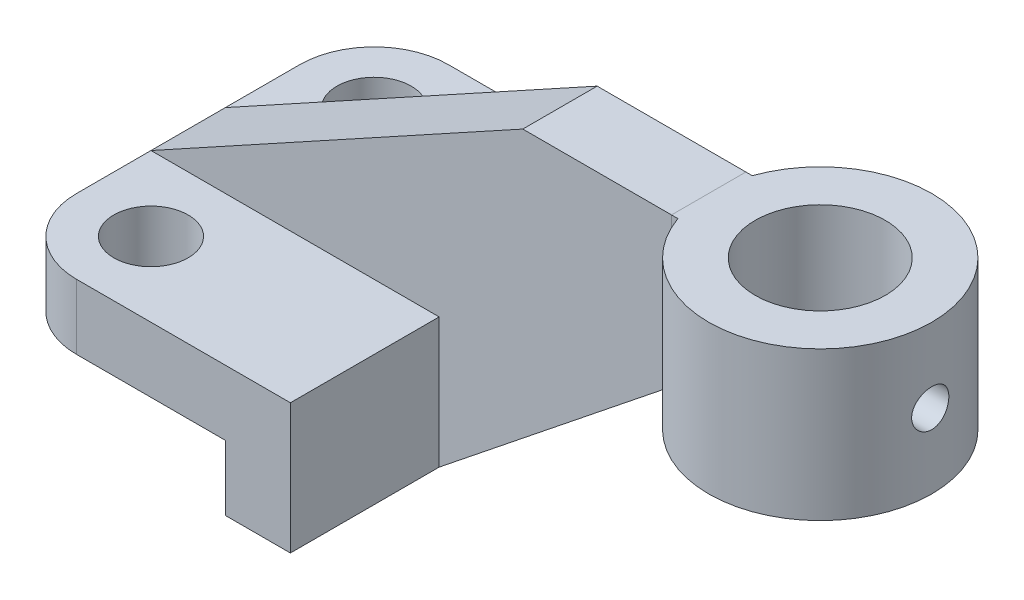
ISO-10303-21;
HEADER;
FILE_DESCRIPTION(('STEP AP214'),'2;1');
FILE_NAME('part.step','',(''),(''),'','','');
FILE_SCHEMA(('AUTOMOTIVE_DESIGN { 1 0 10303 214 1 1 1 1 }'));
ENDSEC;
DATA;
#1=APPLICATION_CONTEXT('core data for automotive mechanical design processes');
#2=APPLICATION_PROTOCOL_DEFINITION('international standard','automotive_design',2000,#1);
#3=PRODUCT_CONTEXT('',#1,'mechanical');
#4=PRODUCT('Part','Part','',(#3));
#5=PRODUCT_RELATED_PRODUCT_CATEGORY('part','',(#4));
#6=PRODUCT_DEFINITION_FORMATION('','',#4);
#7=PRODUCT_DEFINITION_CONTEXT('part definition',#1,'design');
#8=PRODUCT_DEFINITION('design','',#6,#7);
#9=PRODUCT_DEFINITION_SHAPE('','',#8);
#10=(LENGTH_UNIT() NAMED_UNIT(*) SI_UNIT(.MILLI.,.METRE.));
#11=(NAMED_UNIT(*) PLANE_ANGLE_UNIT() SI_UNIT($,.RADIAN.));
#12=(NAMED_UNIT(*) SI_UNIT($,.STERADIAN.) SOLID_ANGLE_UNIT());
#13=UNCERTAINTY_MEASURE_WITH_UNIT(LENGTH_MEASURE(1.E-05),#10,'distance_accuracy_value','');
#14=(GEOMETRIC_REPRESENTATION_CONTEXT(3) GLOBAL_UNCERTAINTY_ASSIGNED_CONTEXT((#13)) GLOBAL_UNIT_ASSIGNED_CONTEXT((#10,
#11,#12)) REPRESENTATION_CONTEXT('',''));
#15=CARTESIAN_POINT('',(0.,0.,0.));
#16=DIRECTION('',(0.,0.,1.));
#17=DIRECTION('',(1.,0.,0.));
#18=AXIS2_PLACEMENT_3D('',#15,#16,#17);
#19=CARTESIAN_POINT('',(25.4,9.525,-6.35));
#20=DIRECTION('',(-1.,0.,0.));
#21=DIRECTION('',(0.,0.,1.));
#22=AXIS2_PLACEMENT_3D('',#19,#20,#21);
#23=PLANE('',#22);
#24=DIRECTION('',(0.,0.,1.));
#25=VECTOR('',#24,1.);
#26=CARTESIAN_POINT('',(25.4,34.925,-6.35));
#27=LINE('',#26,#25);
#28=CARTESIAN_POINT('',(25.4,34.925,-6.35));
#29=VERTEX_POINT('',#28);
#30=CARTESIAN_POINT('',(25.4,34.925,6.35));
#31=VERTEX_POINT('',#30);
#32=EDGE_CURVE('E131',#29,#31,#27,.T.);
#33=ORIENTED_EDGE('',*,*,#32,.F.);
#34=DIRECTION('',(0.,1.,0.));
#35=VECTOR('',#34,1.);
#36=CARTESIAN_POINT('',(25.4,9.525,-6.35));
#37=LINE('',#36,#35);
#38=CARTESIAN_POINT('',(25.4,9.525,-6.35));
#39=VERTEX_POINT('',#38);
#40=EDGE_CURVE('E14',#39,#29,#37,.T.);
#41=ORIENTED_EDGE('',*,*,#40,.F.);
#42=DIRECTION('',(0.,0.,1.));
#43=VECTOR('',#42,1.);
#44=CARTESIAN_POINT('',(25.4,9.525,-6.35));
#45=LINE('',#44,#43);
#46=CARTESIAN_POINT('',(25.4,9.525,6.35));
#47=VERTEX_POINT('',#46);
#48=EDGE_CURVE('E124',#39,#47,#45,.T.);
#49=ORIENTED_EDGE('',*,*,#48,.T.);
#50=DIRECTION('',(0.,1.,0.));
#51=VECTOR('',#50,1.);
#52=CARTESIAN_POINT('',(25.4,9.525,6.35));
#53=LINE('',#52,#51);
#54=EDGE_CURVE('E107',#47,#31,#53,.T.);
#55=ORIENTED_EDGE('',*,*,#54,.T.);
#56=EDGE_LOOP('',(#33,#41,#49,#55));
#57=FACE_BOUND('',#56,.T.);
#58=ADVANCED_FACE('F60',(#57),#23,.T.);
#59=CARTESIAN_POINT('',(25.4,9.525,-6.35));
#60=DIRECTION('',(0.,0.,-1.));
#61=DIRECTION('',(-1.,0.,0.));
#62=AXIS2_PLACEMENT_3D('',#59,#60,#61);
#63=PLANE('',#62);
#64=DIRECTION('',(-1.,0.,0.));
#65=VECTOR('',#64,1.);
#66=CARTESIAN_POINT('',(25.4,34.925,-6.35));
#67=LINE('',#66,#65);
#68=CARTESIAN_POINT('',(26.4894877578617,34.925,-6.35));
#69=VERTEX_POINT('',#68);
#70=EDGE_CURVE('E126',#69,#29,#67,.T.);
#71=ORIENTED_EDGE('',*,*,#70,.F.);
#72=DIRECTION('',(0.,1.,0.));
#73=VECTOR('',#72,1.);
#74=CARTESIAN_POINT('',(26.4894877578617,9.525,-6.35));
#75=LINE('',#74,#73);
#76=CARTESIAN_POINT('',(26.4894877578617,9.525,-6.35));
#77=VERTEX_POINT('',#76);
#78=EDGE_CURVE('E73',#77,#69,#75,.T.);
#79=ORIENTED_EDGE('',*,*,#78,.F.);
#80=DIRECTION('',(-1.,0.,0.));
#81=VECTOR('',#80,1.);
#82=CARTESIAN_POINT('',(25.4,9.525,-6.35));
#83=LINE('',#82,#81);
#84=EDGE_CURVE('E121',#77,#39,#83,.T.);
#85=ORIENTED_EDGE('',*,*,#84,.T.);
#86=ORIENTED_EDGE('',*,*,#40,.T.);
#87=EDGE_LOOP('',(#71,#79,#85,#86));
#88=FACE_BOUND('',#87,.T.);
#89=ADVANCED_FACE('F142',(#88),#63,.T.);
#90=CARTESIAN_POINT('',(44.45,9.525,0.));
#91=DIRECTION('',(0.,1.,0.));
#92=DIRECTION('',(0.,0.,1.));
#93=AXIS2_PLACEMENT_3D('',#90,#91,#92);
#94=CYLINDRICAL_SURFACE('',#93,19.05);
#95=CARTESIAN_POINT('',(63.2335533113412,22.225,-3.175));
#96=CARTESIAN_POINT('',(63.2335565065558,22.4020072001655,-3.17499288599318));
#97=CARTESIAN_POINT('',(63.2360824732924,22.5791110597108,-3.16014756466592));
#98=CARTESIAN_POINT('',(63.2459042064405,22.9283495499442,-3.1011843336443));
#99=CARTESIAN_POINT('',(63.2532043714989,23.1004794450727,-3.05703942859193));
#100=CARTESIAN_POINT('',(63.2717252389648,23.4346651998438,-2.94084952046153));
#101=CARTESIAN_POINT('',(63.2829426640368,23.5967293478011,-2.86882783476362));
#102=CARTESIAN_POINT('',(63.308030255699,23.9064558124916,-2.69898685104962));
#103=CARTESIAN_POINT('',(63.3219001237167,24.0541197473632,-2.60117045614669));
#104=CARTESIAN_POINT('',(63.3508825836796,24.3323273191756,-2.38148815924751));
#105=CARTESIAN_POINT('',(63.3660050600649,24.4627084168605,-2.25941769214407));
#106=CARTESIAN_POINT('',(63.3957010044909,24.7012374997145,-1.995134445963));
#107=CARTESIAN_POINT('',(63.410274439951,24.8093841671566,-1.85292047392046));
#108=CARTESIAN_POINT('',(63.4373348596803,25.0009845003685,-1.55133404483441));
#109=CARTESIAN_POINT('',(63.4498088688907,25.0842868998194,-1.39186422345002));
#110=CARTESIAN_POINT('',(63.471154959355,25.2228617595738,-1.06095243958931));
#111=CARTESIAN_POINT('',(63.4800272748027,25.2781360424138,-0.889511256379298));
#112=CARTESIAN_POINT('',(63.4931005309998,25.3585885194296,-0.541202532457187));
#113=CARTESIAN_POINT('',(63.4973438345085,25.384039803326,-0.364399686082673));
#114=CARTESIAN_POINT('',(63.5008265076532,25.4049730077738,-0.00898561261776089));
#115=CARTESIAN_POINT('',(63.5000662174102,25.400456965364,0.169625490731702));
#116=CARTESIAN_POINT('',(63.4936609020786,25.3617966835592,0.521718775050173));
#117=CARTESIAN_POINT('',(63.4880643328934,25.3279463424704,0.69523423398918));
#118=CARTESIAN_POINT('',(63.4726693303997,25.232041135707,1.03408731410698));
#119=CARTESIAN_POINT('',(63.4628707691177,25.1699854110213,1.19942468604741));
#120=CARTESIAN_POINT('',(63.4400902711018,25.0191388867995,1.51810230768396));
#121=CARTESIAN_POINT('',(63.4270939650513,24.9302269846553,1.67138416423419));
#122=CARTESIAN_POINT('',(63.399361873508,24.7282807152535,1.96096322290524));
#123=CARTESIAN_POINT('',(63.384625947273,24.6152443956373,2.09725904895316));
#124=CARTESIAN_POINT('',(63.3548424065539,24.3666279155935,2.35073351727727));
#125=CARTESIAN_POINT('',(63.3397931795842,24.2307908894757,2.46766016786157));
#126=CARTESIAN_POINT('',(63.311252089267,23.9412943954259,2.67710232732904));
#127=CARTESIAN_POINT('',(63.2977602402858,23.7876347631128,2.76961761103617));
#128=CARTESIAN_POINT('',(63.273860682935,23.4665626148156,2.92766043180012));
#129=CARTESIAN_POINT('',(63.263456445943,23.299134887423,2.99315762464464));
#130=CARTESIAN_POINT('',(63.2469675963614,22.9554416781694,3.09502793593583));
#131=CARTESIAN_POINT('',(63.2408826034316,22.7791769759308,3.1314036187753));
#132=CARTESIAN_POINT('',(63.2337947846608,22.4250679816741,3.17364349379667));
#133=CARTESIAN_POINT('',(63.2327321291351,22.2472676977783,3.1798669040488));
#134=CARTESIAN_POINT('',(63.235649941736,21.8931659269527,3.16258283240672));
#135=CARTESIAN_POINT('',(63.2396302150745,21.7168643823973,3.13907649885332));
#136=CARTESIAN_POINT('',(63.2521301306787,21.3719057458276,3.06330646535868));
#137=CARTESIAN_POINT('',(63.260620899363,21.2032073523549,3.01122561412091));
#138=CARTESIAN_POINT('',(63.2811608771698,20.876932888825,2.87997670154419));
#139=CARTESIAN_POINT('',(63.2932102991603,20.7193574848104,2.80080701978819));
#140=CARTESIAN_POINT('',(63.3196489306469,20.4182032651042,2.61677997500111));
#141=CARTESIAN_POINT('',(63.3340586961244,20.2747669525998,2.51169241648239));
#142=CARTESIAN_POINT('',(63.3635342668343,20.0074358134773,2.27912862144913));
#143=CARTESIAN_POINT('',(63.3786001181537,19.8835423624906,2.15165081020773));
#144=CARTESIAN_POINT('',(63.4078795609019,19.6575020962345,1.87633364931759));
#145=CARTESIAN_POINT('',(63.4220826595773,19.5555948406186,1.72829633180047));
#146=CARTESIAN_POINT('',(63.4478679278983,19.3780977347038,1.41699417889564));
#147=CARTESIAN_POINT('',(63.4594501823187,19.3025070331182,1.25372983628769));
#148=CARTESIAN_POINT('',(63.4786431487536,19.1801615583773,0.917319795406684));
#149=CARTESIAN_POINT('',(63.4862711040087,19.1332814238167,0.744220714505314));
#150=CARTESIAN_POINT('',(63.4967689062499,19.0692841893159,0.392469033290245));
#151=CARTESIAN_POINT('',(63.4996391447424,19.0521646404099,0.213816891163455));
#152=CARTESIAN_POINT('',(63.5002925811752,19.0482450094635,-0.141657420232572));
#153=CARTESIAN_POINT('',(63.4981369357072,19.0610804274948,-0.318475563965387));
#154=CARTESIAN_POINT('',(63.4891056655191,19.1159179812822,-0.667400207379679));
#155=CARTESIAN_POINT('',(63.4822300672288,19.1579199537173,-0.839506733438703));
#156=CARTESIAN_POINT('',(63.464528758108,19.2697584702404,-1.17398348631655));
#157=CARTESIAN_POINT('',(63.4537074464191,19.3395640236268,-1.33636432263535));
#158=CARTESIAN_POINT('',(63.429296012351,19.5049875790128,-1.64716517528736));
#159=CARTESIAN_POINT('',(63.4157057587261,19.6006068046293,-1.79558452937014));
#160=CARTESIAN_POINT('',(63.3870668961284,19.8162355674248,-2.07608544081853));
#161=CARTESIAN_POINT('',(63.3720033616722,19.9365120125341,-2.20796031686549));
#162=CARTESIAN_POINT('',(63.3422190520924,20.1974809510378,-2.44978412245766));
#163=CARTESIAN_POINT('',(63.3274983580787,20.3381782198189,-2.55972790912412));
#164=CARTESIAN_POINT('',(63.2999539628806,20.6371765595618,-2.7552831240568));
#165=CARTESIAN_POINT('',(63.2871444166414,20.7955951115022,-2.84071693610328));
#166=CARTESIAN_POINT('',(63.2650399681597,21.1246837295144,-2.98362946123343));
#167=CARTESIAN_POINT('',(63.2557415569059,21.2953413598003,-3.0411361011333));
#168=CARTESIAN_POINT('',(63.2437742596774,21.593052787249,-3.11407308747183));
#169=CARTESIAN_POINT('',(63.2399627174272,21.7183040461125,-3.13688402044266));
#170=CARTESIAN_POINT('',(63.2348511181585,21.9706869257429,-3.16734989488027));
#171=CARTESIAN_POINT('',(63.2335510155468,22.0978185123317,-3.17500511148682));
#172=CARTESIAN_POINT('',(63.2335533113412,22.225,-3.175));
#173=B_SPLINE_CURVE_WITH_KNOTS('',3,(#95,#96,#97,#98,#99,#100,#101,#102,#103,#104,#105,#106,
#107,#108,#109,#110,#111,#112,#113,#114,#115,#116,#117,#118,#119,#120,#121,#122,#123,#124,#125,
#126,#127,#128,#129,#130,#131,#132,#133,#134,#135,#136,#137,#138,#139,#140,#141,#142,#143,#144,
#145,#146,#147,#148,#149,#150,#151,#152,#153,#154,#155,#156,#157,#158,#159,#160,#161,#162,#163,
#164,#165,#166,#167,#168,#169,#170,#171,#172),.UNSPECIFIED.,.T.,.F.,(4,2,2,2,2,2,2,2,2,2,2,2,2,
2,2,2,2,2,2,2,2,2,2,2,2,2,2,2,2,2,2,2,2,2,2,2,2,2,4),(0.,0.530556519438233,1.06160255035297,
1.59220534730149,2.12274845204698,2.65797232127758,3.19322790149748,3.73167884741523,
4.27009477591114,4.80354090690158,5.33695077708919,5.86507743879129,6.39322018596907,
6.9237809725707,7.45438471307991,7.99142576796897,8.52847177647444,9.06611931373227,
9.60371950141358,10.1348989887392,10.6660579593575,11.1938570208707,11.7216876601284,
12.2543867530863,12.7871233262698,13.3254002355493,13.8636597310541,14.3995519021041,
14.9353999730869,15.4647617585771,15.9941205798791,16.5228910058722,17.0516865009827,
17.5865408677833,18.121520511799,18.6602843407527,19.1985082976546,19.5797255159058,
19.9609358134031),.UNSPECIFIED.);
#174=CARTESIAN_POINT('',(63.2335533113412,22.225,-3.175));
#175=VERTEX_POINT('',#174);
#176=EDGE_CURVE('E155',#175,#175,#173,.T.);
#177=ORIENTED_EDGE('',*,*,#176,.F.);
#178=EDGE_LOOP('',(#177));
#179=FACE_BOUND('',#178,.T.);
#180=CARTESIAN_POINT('',(44.45,34.925,0.));
#181=DIRECTION('',(0.,1.,0.));
#182=DIRECTION('',(0.,0.,1.));
#183=AXIS2_PLACEMENT_3D('',#180,#181,#182);
#184=CIRCLE('',#183,19.05);
#185=CARTESIAN_POINT('',(26.4894877578617,34.925,6.35));
#186=VERTEX_POINT('',#185);
#187=EDGE_CURVE('E115',#186,#69,#184,.T.);
#188=ORIENTED_EDGE('',*,*,#187,.F.);
#189=DIRECTION('',(0.,1.,0.));
#190=VECTOR('',#189,1.);
#191=CARTESIAN_POINT('',(26.4894877578617,9.525,6.35));
#192=LINE('',#191,#190);
#193=CARTESIAN_POINT('',(26.4894877578617,9.525,6.35));
#194=VERTEX_POINT('',#193);
#195=EDGE_CURVE('E110',#194,#186,#192,.T.);
#196=ORIENTED_EDGE('',*,*,#195,.F.);
#197=CARTESIAN_POINT('',(44.45,9.525,0.));
#198=DIRECTION('',(0.,1.,0.));
#199=DIRECTION('',(0.,0.,1.));
#200=AXIS2_PLACEMENT_3D('',#197,#198,#199);
#201=CIRCLE('',#200,19.05);
#202=EDGE_CURVE('E113',#194,#77,#201,.T.);
#203=ORIENTED_EDGE('',*,*,#202,.T.);
#204=ORIENTED_EDGE('',*,*,#78,.T.);
#205=EDGE_LOOP('',(#188,#196,#203,#204));
#206=FACE_BOUND('',#205,.T.);
#207=ADVANCED_FACE('F112',(#179,#206),#94,.T.);
#208=CARTESIAN_POINT('',(25.4,9.525,6.35));
#209=DIRECTION('',(0.,0.,1.));
#210=DIRECTION('',(1.,0.,0.));
#211=AXIS2_PLACEMENT_3D('',#208,#209,#210);
#212=PLANE('',#211);
#213=DIRECTION('',(1.,0.,0.));
#214=VECTOR('',#213,1.);
#215=CARTESIAN_POINT('',(25.4,34.925,6.35));
#216=LINE('',#215,#214);
#217=EDGE_CURVE('E134',#31,#186,#216,.T.);
#218=ORIENTED_EDGE('',*,*,#217,.F.);
#219=ORIENTED_EDGE('',*,*,#54,.F.);
#220=DIRECTION('',(1.,0.,0.));
#221=VECTOR('',#220,1.);
#222=CARTESIAN_POINT('',(25.4,9.525,6.35));
#223=LINE('',#222,#221);
#224=EDGE_CURVE('E120',#47,#194,#223,.T.);
#225=ORIENTED_EDGE('',*,*,#224,.T.);
#226=ORIENTED_EDGE('',*,*,#195,.T.);
#227=EDGE_LOOP('',(#218,#219,#225,#226));
#228=FACE_BOUND('',#227,.T.);
#229=ADVANCED_FACE('F123',(#228),#212,.T.);
#230=CARTESIAN_POINT('',(44.45,9.525,0.));
#231=DIRECTION('',(0.,1.,0.));
#232=DIRECTION('',(0.,0.,1.));
#233=AXIS2_PLACEMENT_3D('',#230,#231,#232);
#234=PLANE('',#233);
#235=CARTESIAN_POINT('',(44.45,9.525,0.));
#236=DIRECTION('',(0.,1.,0.));
#237=DIRECTION('',(0.,0.,1.));
#238=AXIS2_PLACEMENT_3D('',#235,#236,#237);
#239=CIRCLE('',#238,11.1125);
#240=CARTESIAN_POINT('',(44.45,9.525,11.1125));
#241=VERTEX_POINT('',#240);
#242=EDGE_CURVE('E135',#241,#241,#239,.T.);
#243=ORIENTED_EDGE('',*,*,#242,.T.);
#244=EDGE_LOOP('',(#243));
#245=FACE_BOUND('',#244,.T.);
#246=ORIENTED_EDGE('',*,*,#48,.F.);
#247=ORIENTED_EDGE('',*,*,#84,.F.);
#248=ORIENTED_EDGE('',*,*,#202,.F.);
#249=ORIENTED_EDGE('',*,*,#224,.F.);
#250=EDGE_LOOP('',(#246,#247,#248,#249));
#251=FACE_BOUND('',#250,.T.);
#252=ADVANCED_FACE('F119',(#245,#251),#234,.F.);
#253=CARTESIAN_POINT('',(44.45,34.925,0.));
#254=DIRECTION('',(0.,1.,0.));
#255=DIRECTION('',(0.,0.,1.));
#256=AXIS2_PLACEMENT_3D('',#253,#254,#255);
#257=PLANE('',#256);
#258=CARTESIAN_POINT('',(44.45,34.925,0.));
#259=DIRECTION('',(0.,1.,0.));
#260=DIRECTION('',(0.,0.,1.));
#261=AXIS2_PLACEMENT_3D('',#258,#259,#260);
#262=CIRCLE('',#261,11.1125);
#263=CARTESIAN_POINT('',(44.45,34.925,11.1125));
#264=VERTEX_POINT('',#263);
#265=EDGE_CURVE('E160',#264,#264,#262,.T.);
#266=ORIENTED_EDGE('',*,*,#265,.F.);
#267=EDGE_LOOP('',(#266));
#268=FACE_BOUND('',#267,.T.);
#269=ORIENTED_EDGE('',*,*,#32,.T.);
#270=ORIENTED_EDGE('',*,*,#217,.T.);
#271=ORIENTED_EDGE('',*,*,#187,.T.);
#272=ORIENTED_EDGE('',*,*,#70,.T.);
#273=EDGE_LOOP('',(#269,#270,#271,#272));
#274=FACE_BOUND('',#273,.T.);
#275=ADVANCED_FACE('F141',(#268,#274),#257,.T.);
#276=CARTESIAN_POINT('',(44.45,9.525,0.));
#277=DIRECTION('',(0.,1.,0.));
#278=DIRECTION('',(0.,0.,1.));
#279=AXIS2_PLACEMENT_3D('',#276,#277,#278);
#280=CYLINDRICAL_SURFACE('',#279,11.1125);
#281=CARTESIAN_POINT('',(55.0992737428427,22.225,-3.175));
#282=CARTESIAN_POINT('',(55.0992761838029,22.3993893163823,-3.17499685748805));
#283=CARTESIAN_POINT('',(55.1036042274138,22.5738103962546,-3.16058338226828));
#284=CARTESIAN_POINT('',(55.1203874286563,22.9175805916944,-3.10344126881893));
#285=CARTESIAN_POINT('',(55.132845891955,23.0869276149471,-3.06070111341419));
#286=CARTESIAN_POINT('',(55.1643662636562,23.4155253063837,-2.94845332477437));
#287=CARTESIAN_POINT('',(55.1834179422112,23.5747911660097,-2.87898714034853));
#288=CARTESIAN_POINT('',(55.2259646224008,23.8794414008425,-2.71539277949911));
#289=CARTESIAN_POINT('',(55.2494601514998,24.0248241251001,-2.62126167495325));
#290=CARTESIAN_POINT('',(55.2990033085248,24.3017541099373,-2.40811812155892));
#291=CARTESIAN_POINT('',(55.3251013759309,24.4328438858801,-2.28852287267284));
#292=CARTESIAN_POINT('',(55.3764762025032,24.6734056684948,-2.02909685218247));
#293=CARTESIAN_POINT('',(55.4017528652092,24.7828751438325,-1.88926371441592));
#294=CARTESIAN_POINT('',(55.449205395524,24.9790404792612,-1.59011307605018));
#295=CARTESIAN_POINT('',(55.4713148652012,25.0652750213547,-1.43048161922197));
#296=CARTESIAN_POINT('',(55.5093590802078,25.2095028168853,-1.09824595444293));
#297=CARTESIAN_POINT('',(55.5252950275925,25.2675015687189,-0.925644279764337));
#298=CARTESIAN_POINT('',(55.5488398688912,25.352112207218,-0.577149238004871));
#299=CARTESIAN_POINT('',(55.5566552538044,25.3795038219562,-0.401459379529854));
#300=CARTESIAN_POINT('',(55.5638032685977,25.4045826900396,-0.0478156625948046));
#301=CARTESIAN_POINT('',(55.5631375199815,25.4022756214605,0.130137756596824));
#302=CARTESIAN_POINT('',(55.5535466073674,25.3685573798176,0.477806060729654));
#303=CARTESIAN_POINT('',(55.5448608235694,25.3379896899372,0.647610379447928));
#304=CARTESIAN_POINT('',(55.5204929454913,25.2499890248378,0.979570402706984));
#305=CARTESIAN_POINT('',(55.5048104255192,25.1925544149837,1.14172564120213));
#306=CARTESIAN_POINT('',(55.4678696293806,25.0518463262114,1.45585471104459));
#307=CARTESIAN_POINT('',(55.4465522624989,24.9682971902298,1.60769783211282));
#308=CARTESIAN_POINT('',(55.4006189574691,24.7779467190926,1.89548649920017));
#309=CARTESIAN_POINT('',(55.3760022969452,24.6711402885775,2.03142855146146));
#310=CARTESIAN_POINT('',(55.3251002179126,24.4328859343951,2.28859182956847));
#311=CARTESIAN_POINT('',(55.2987865536486,24.3007047741599,2.4091290044119));
#312=CARTESIAN_POINT('',(55.2482222089589,24.0177397916866,2.62650766250686));
#313=CARTESIAN_POINT('',(55.2239716960232,23.866954461564,2.72334722314526));
#314=CARTESIAN_POINT('',(55.1801533998371,23.5494022208827,2.89120795875691));
#315=CARTESIAN_POINT('',(55.160624547373,23.3825173303283,2.96201683734446));
#316=CARTESIAN_POINT('',(55.1289306408742,23.0385093530381,3.07433585494716));
#317=CARTESIAN_POINT('',(55.1167634443764,22.8613892615083,3.11585451887877));
#318=CARTESIAN_POINT('',(55.1016347040645,22.5083998263508,3.16718024806073));
#319=CARTESIAN_POINT('',(55.0983739172391,22.332693115613,3.17801860200136));
#320=CARTESIAN_POINT('',(55.1006035335128,21.9819722984813,3.17053907292132));
#321=CARTESIAN_POINT('',(55.106092844984,21.8069581084217,3.15222482686531));
#322=CARTESIAN_POINT('',(55.1249124521254,21.4667445505121,3.08787453013747));
#323=CARTESIAN_POINT('',(55.1380603320826,21.3014122072005,3.04248283717346));
#324=CARTESIAN_POINT('',(55.1705313898943,20.980714528204,2.92600319462933));
#325=CARTESIAN_POINT('',(55.1898554587627,20.8253506345126,2.85491153722488));
#326=CARTESIAN_POINT('',(55.2330967346507,20.5247524555933,2.68703369630583));
#327=CARTESIAN_POINT('',(55.2571157584257,20.379863919829,2.58965528119998));
#328=CARTESIAN_POINT('',(55.3068129089781,20.1081062571587,2.37268486099684));
#329=CARTESIAN_POINT('',(55.3324913945432,19.9812410461182,2.25308804156917));
#330=CARTESIAN_POINT('',(55.383663798048,19.7447226734675,1.99026146582032));
#331=CARTESIAN_POINT('',(55.4091221959825,19.6357954828728,1.84636999000687));
#332=CARTESIAN_POINT('',(55.4561053856052,19.4436274808049,1.54175667495385));
#333=CARTESIAN_POINT('',(55.4776303828684,19.3603853267732,1.38103571598086));
#334=CARTESIAN_POINT('',(55.5141845144367,19.2227449443457,1.04843782081791));
#335=CARTESIAN_POINT('',(55.52926264152,19.168128431532,0.876656869840671));
#336=CARTESIAN_POINT('',(55.5514405165292,19.08869245192,0.525852467072997));
#337=CARTESIAN_POINT('',(55.558542316828,19.0638653199622,0.34683089064187));
#338=CARTESIAN_POINT('',(55.563854693177,19.0452510985285,-0.00663295275995317));
#339=CARTESIAN_POINT('',(55.5623682944748,19.050406163331,-0.181015689291777));
#340=CARTESIAN_POINT('',(55.5513727223143,19.0891132717389,-0.526327961219967));
#341=CARTESIAN_POINT('',(55.5418639330474,19.1226639554817,-0.697257661580458));
#342=CARTESIAN_POINT('',(55.5159672295276,19.2165785355538,-1.02934156120022));
#343=CARTESIAN_POINT('',(55.4996415730085,19.2767000465729,-1.19056949057769));
#344=CARTESIAN_POINT('',(55.4618063695336,19.4218340262788,-1.50073868438428));
#345=CARTESIAN_POINT('',(55.4402960201143,19.5068503485114,-1.64967804204854));
#346=CARTESIAN_POINT('',(55.3935734175888,19.7022995231594,-1.93585061196008));
#347=CARTESIAN_POINT('',(55.3682701017648,19.8134130127671,-2.07260400820459));
#348=CARTESIAN_POINT('',(55.3171370317528,20.0566482366676,-2.32587994043708));
#349=CARTESIAN_POINT('',(55.2913071338377,20.1887757753825,-2.44239686812614));
#350=CARTESIAN_POINT('',(55.241254095657,20.474458855698,-2.65494843068978));
#351=CARTESIAN_POINT('',(55.2170909829964,20.6284860915332,-2.75036465289593));
#352=CARTESIAN_POINT('',(55.1740140683233,20.9510659610567,-2.91382360487));
#353=CARTESIAN_POINT('',(55.1550973302231,21.1196104008169,-2.98188165502359));
#354=CARTESIAN_POINT('',(55.126865545747,21.443400249145,-3.08131422746672));
#355=CARTESIAN_POINT('',(55.1166099665665,21.5974459276197,-3.11635616221492));
#356=CARTESIAN_POINT('',(55.1028134902042,21.9093194628768,-3.16319863681361));
#357=CARTESIAN_POINT('',(55.0992715333406,22.0671467187899,-3.17500284453103));
#358=CARTESIAN_POINT('',(55.0992737428427,22.225,-3.175));
#359=B_SPLINE_CURVE_WITH_KNOTS('',3,(#281,#282,#283,#284,#285,#286,#287,#288,#289,#290,#291,
#292,#293,#294,#295,#296,#297,#298,#299,#300,#301,#302,#303,#304,#305,#306,#307,#308,#309,#310,
#311,#312,#313,#314,#315,#316,#317,#318,#319,#320,#321,#322,#323,#324,#325,#326,#327,#328,#329,
#330,#331,#332,#333,#334,#335,#336,#337,#338,#339,#340,#341,#342,#343,#344,#345,#346,#347,#348,
#349,#350,#351,#352,#353,#354,#355,#356,#357,#358),.UNSPECIFIED.,.T.,.F.,(4,2,2,2,2,2,2,2,2,2,2,
2,2,2,2,2,2,2,2,2,2,2,2,2,2,2,2,2,2,2,2,2,2,2,2,2,2,2,4),(0.,0.522586493502769,1.04538559276994,
1.56737714168159,2.08943068747417,2.62504502940503,3.16072204466092,3.70635979284481,
4.25189124565608,4.78318355383128,5.31437428601963,5.83020547258931,6.34606804740103,
6.86757109113355,7.38918850430926,7.92911185150138,8.46907898874744,9.01335701502349,
9.55747656376195,10.0830755179669,10.6086089056358,11.122108973345,11.6356831551025,
12.1619645959707,12.6883602058921,13.2325330405273,13.7766774263917,14.3166097541551,
14.8564031211395,15.3772695007824,15.8981109376108,16.4142961717266,16.9305613500466,
17.4621788288807,17.9939434049535,18.5396760972508,19.0851027558804,19.5582109608376,
20.0312444839156),.UNSPECIFIED.);
#360=CARTESIAN_POINT('',(55.0992737428427,22.225,-3.175));
#361=VERTEX_POINT('',#360);
#362=EDGE_CURVE('E63',#361,#361,#359,.T.);
#363=ORIENTED_EDGE('',*,*,#362,.T.);
#364=EDGE_LOOP('',(#363));
#365=FACE_BOUND('',#364,.T.);
#366=ORIENTED_EDGE('',*,*,#242,.F.);
#367=EDGE_LOOP('',(#366));
#368=FACE_BOUND('',#367,.T.);
#369=ORIENTED_EDGE('',*,*,#265,.T.);
#370=EDGE_LOOP('',(#369));
#371=FACE_BOUND('',#370,.T.);
#372=ADVANCED_FACE('F164',(#365,#368,#371),#280,.F.);
#373=CARTESIAN_POINT('',(44.45,22.225,0.));
#374=DIRECTION('',(1.,0.,0.));
#375=DIRECTION('',(0.,0.,-1.));
#376=AXIS2_PLACEMENT_3D('',#373,#374,#375);
#377=CYLINDRICAL_SURFACE('',#376,3.175);
#378=ORIENTED_EDGE('',*,*,#176,.T.);
#379=EDGE_LOOP('',(#378));
#380=FACE_BOUND('',#379,.T.);
#381=ORIENTED_EDGE('',*,*,#362,.F.);
#382=EDGE_LOOP('',(#381));
#383=FACE_BOUND('',#382,.T.);
#384=ADVANCED_FACE('F161',(#380,#383),#377,.F.);
#385=CLOSED_SHELL('',(#58,#89,#207,#229,#252,#275,#372,#384));
#386=MANIFOLD_SOLID_BREP('B2',#385);
#387=CARTESIAN_POINT('',(-14.2875,-11.1125,0.));
#388=DIRECTION('',(-1.,0.,0.));
#389=DIRECTION('',(0.,0.,1.));
#390=AXIS2_PLACEMENT_3D('',#387,#388,#389);
#391=PLANE('',#390);
#392=DIRECTION('',(0.,-1.,0.));
#393=VECTOR('',#392,1.);
#394=CARTESIAN_POINT('',(-14.2875,0.,-6.35));
#395=LINE('',#394,#393);
#396=CARTESIAN_POINT('',(-14.2875,0.,-6.35));
#397=VERTEX_POINT('',#396);
#398=CARTESIAN_POINT('',(-14.2875,-22.225,-6.35));
#399=VERTEX_POINT('',#398);
#400=EDGE_CURVE('E466',#397,#399,#395,.T.);
#401=ORIENTED_EDGE('',*,*,#400,.T.);
#402=DIRECTION('',(0.,0.,1.));
#403=VECTOR('',#402,1.);
#404=CARTESIAN_POINT('',(-14.2875,-22.225,31.75));
#405=LINE('',#404,#403);
#406=CARTESIAN_POINT('',(-14.2875,-22.225,-31.75));
#407=VERTEX_POINT('',#406);
#408=EDGE_CURVE('E447',#407,#399,#405,.T.);
#409=ORIENTED_EDGE('',*,*,#408,.F.);
#410=DIRECTION('',(0.,1.,0.));
#411=VECTOR('',#410,1.);
#412=CARTESIAN_POINT('',(-14.2875,-11.1125,-31.75));
#413=LINE('',#412,#411);
#414=CARTESIAN_POINT('',(-14.2875,0.,-31.75));
#415=VERTEX_POINT('',#414);
#416=EDGE_CURVE('E58',#407,#415,#413,.T.);
#417=ORIENTED_EDGE('',*,*,#416,.T.);
#418=DIRECTION('',(0.,0.,1.));
#419=VECTOR('',#418,1.);
#420=CARTESIAN_POINT('',(-14.2875,0.,0.));
#421=LINE('',#420,#419);
#422=EDGE_CURVE('E370',#415,#397,#421,.T.);
#423=ORIENTED_EDGE('',*,*,#422,.T.);
#424=EDGE_LOOP('',(#401,#409,#417,#423));
#425=FACE_BOUND('',#424,.T.);
#426=ADVANCED_FACE('F239',(#425),#391,.F.);
#427=CARTESIAN_POINT('',(0.,0.,0.));
#428=DIRECTION('',(0.,1.,0.));
#429=DIRECTION('',(0.,0.,1.));
#430=AXIS2_PLACEMENT_3D('',#427,#428,#429);
#431=PLANE('',#430);
#432=CARTESIAN_POINT('',(-50.8,0.,-19.05));
#433=DIRECTION('',(0.,1.,0.));
#434=DIRECTION('',(0.,0.,1.));
#435=AXIS2_PLACEMENT_3D('',#432,#433,#434);
#436=CIRCLE('',#435,6.35);
#437=CARTESIAN_POINT('',(-50.8,0.,-12.7));
#438=VERTEX_POINT('',#437);
#439=EDGE_CURVE('E409',#438,#438,#436,.T.);
#440=ORIENTED_EDGE('',*,*,#439,.F.);
#441=EDGE_LOOP('',(#440));
#442=FACE_BOUND('',#441,.T.);
#443=DIRECTION('',(0.,0.,-1.));
#444=VECTOR('',#443,1.);
#445=CARTESIAN_POINT('',(-63.5,0.,0.));
#446=LINE('',#445,#444);
#447=CARTESIAN_POINT('',(-63.5,0.,-6.35));
#448=VERTEX_POINT('',#447);
#449=CARTESIAN_POINT('',(-63.5,0.,-19.05));
#450=VERTEX_POINT('',#449);
#451=EDGE_CURVE('E422',#448,#450,#446,.T.);
#452=ORIENTED_EDGE('',*,*,#451,.F.);
#453=DIRECTION('',(1.,0.,0.));
#454=VECTOR('',#453,1.);
#455=CARTESIAN_POINT('',(0.,0.,-6.35));
#456=LINE('',#455,#454);
#457=EDGE_CURVE('E471',#448,#397,#456,.T.);
#458=ORIENTED_EDGE('',*,*,#457,.T.);
#459=ORIENTED_EDGE('',*,*,#422,.F.);
#460=DIRECTION('',(-1.,0.,0.));
#461=VECTOR('',#460,1.);
#462=CARTESIAN_POINT('',(0.,0.,-31.75));
#463=LINE('',#462,#461);
#464=CARTESIAN_POINT('',(-50.8,0.,-31.75));
#465=VERTEX_POINT('',#464);
#466=EDGE_CURVE('E416',#415,#465,#463,.T.);
#467=ORIENTED_EDGE('',*,*,#466,.T.);
#468=CARTESIAN_POINT('',(-50.8,0.,-19.05));
#469=DIRECTION('',(0.,1.,0.));
#470=DIRECTION('',(0.,0.,1.));
#471=AXIS2_PLACEMENT_3D('',#468,#469,#470);
#472=CIRCLE('',#471,12.7);
#473=EDGE_CURVE('E419',#450,#465,#472,.F.);
#474=ORIENTED_EDGE('',*,*,#473,.F.);
#475=EDGE_LOOP('',(#452,#458,#459,#467,#474));
#476=FACE_BOUND('',#475,.T.);
#477=ADVANCED_FACE('F520',(#442,#476),#431,.T.);
#478=CARTESIAN_POINT('',(0.,-11.1125,0.));
#479=DIRECTION('',(0.,1.,0.));
#480=DIRECTION('',(0.,0.,1.));
#481=AXIS2_PLACEMENT_3D('',#478,#479,#480);
#482=PLANE('',#481);
#483=CARTESIAN_POINT('',(-50.8,-11.1125,19.05));
#484=DIRECTION('',(0.,1.,0.));
#485=DIRECTION('',(0.,0.,1.));
#486=AXIS2_PLACEMENT_3D('',#483,#484,#485);
#487=CIRCLE('',#486,6.35);
#488=CARTESIAN_POINT('',(-50.8,-11.1125,25.4));
#489=VERTEX_POINT('',#488);
#490=EDGE_CURVE('E393',#489,#489,#487,.T.);
#491=ORIENTED_EDGE('',*,*,#490,.T.);
#492=EDGE_LOOP('',(#491));
#493=FACE_BOUND('',#492,.T.);
#494=CARTESIAN_POINT('',(-50.8,-11.1125,-19.05));
#495=DIRECTION('',(0.,1.,0.));
#496=DIRECTION('',(0.,0.,1.));
#497=AXIS2_PLACEMENT_3D('',#494,#495,#496);
#498=CIRCLE('',#497,6.35);
#499=CARTESIAN_POINT('',(-50.8,-11.1125,-12.7));
#500=VERTEX_POINT('',#499);
#501=EDGE_CURVE('E373',#500,#500,#498,.T.);
#502=ORIENTED_EDGE('',*,*,#501,.T.);
#503=EDGE_LOOP('',(#502));
#504=FACE_BOUND('',#503,.T.);
#505=DIRECTION('',(0.,0.,-1.));
#506=VECTOR('',#505,1.);
#507=CARTESIAN_POINT('',(-25.4,-11.1125,-31.75));
#508=LINE('',#507,#506);
#509=CARTESIAN_POINT('',(-25.4,-11.1125,31.75));
#510=VERTEX_POINT('',#509);
#511=CARTESIAN_POINT('',(-25.4,-11.1125,-31.75));
#512=VERTEX_POINT('',#511);
#513=EDGE_CURVE('E264',#510,#512,#508,.T.);
#514=ORIENTED_EDGE('',*,*,#513,.F.);
#515=DIRECTION('',(1.,0.,0.));
#516=VECTOR('',#515,1.);
#517=CARTESIAN_POINT('',(0.,-11.1125,31.75));
#518=LINE('',#517,#516);
#519=CARTESIAN_POINT('',(-50.8,-11.1125,31.75));
#520=VERTEX_POINT('',#519);
#521=EDGE_CURVE('E388',#520,#510,#518,.T.);
#522=ORIENTED_EDGE('',*,*,#521,.F.);
#523=CARTESIAN_POINT('',(-50.8,-11.1125,19.05));
#524=DIRECTION('',(0.,1.,0.));
#525=DIRECTION('',(0.,0.,1.));
#526=AXIS2_PLACEMENT_3D('',#523,#524,#525);
#527=CIRCLE('',#526,12.7);
#528=CARTESIAN_POINT('',(-63.5,-11.1125,19.05));
#529=VERTEX_POINT('',#528);
#530=EDGE_CURVE('E405',#529,#520,#527,.T.);
#531=ORIENTED_EDGE('',*,*,#530,.F.);
#532=DIRECTION('',(0.,0.,-1.));
#533=VECTOR('',#532,1.);
#534=CARTESIAN_POINT('',(-63.5,-11.1125,0.));
#535=LINE('',#534,#533);
#536=CARTESIAN_POINT('',(-63.5,-11.1125,-19.05));
#537=VERTEX_POINT('',#536);
#538=EDGE_CURVE('E402',#529,#537,#535,.T.);
#539=ORIENTED_EDGE('',*,*,#538,.T.);
#540=CARTESIAN_POINT('',(-50.8,-11.1125,-19.05));
#541=DIRECTION('',(0.,1.,0.));
#542=DIRECTION('',(0.,0.,1.));
#543=AXIS2_PLACEMENT_3D('',#540,#541,#542);
#544=CIRCLE('',#543,12.7);
#545=CARTESIAN_POINT('',(-50.8,-11.1125,-31.75));
#546=VERTEX_POINT('',#545);
#547=EDGE_CURVE('E392',#537,#546,#544,.F.);
#548=ORIENTED_EDGE('',*,*,#547,.T.);
#549=DIRECTION('',(-1.,0.,0.));
#550=VECTOR('',#549,1.);
#551=CARTESIAN_POINT('',(0.,-11.1125,-31.75));
#552=LINE('',#551,#550);
#553=EDGE_CURVE('E389',#512,#546,#552,.T.);
#554=ORIENTED_EDGE('',*,*,#553,.F.);
#555=EDGE_LOOP('',(#514,#522,#531,#539,#548,#554));
#556=FACE_BOUND('',#555,.T.);
#557=ADVANCED_FACE('F517',(#493,#504,#556),#482,.F.);
#558=CARTESIAN_POINT('',(0.,-11.1125,-31.75));
#559=DIRECTION('',(0.,0.,-1.));
#560=DIRECTION('',(-1.,0.,0.));
#561=AXIS2_PLACEMENT_3D('',#558,#559,#560);
#562=PLANE('',#561);
#563=ORIENTED_EDGE('',*,*,#466,.F.);
#564=ORIENTED_EDGE('',*,*,#416,.F.);
#565=DIRECTION('',(1.,0.,0.));
#566=VECTOR('',#565,1.);
#567=CARTESIAN_POINT('',(-14.2875,-22.225,-31.75));
#568=LINE('',#567,#566);
#569=CARTESIAN_POINT('',(-25.4,-22.225,-31.75));
#570=VERTEX_POINT('',#569);
#571=EDGE_CURVE('E439',#570,#407,#568,.T.);
#572=ORIENTED_EDGE('',*,*,#571,.F.);
#573=DIRECTION('',(0.,1.,0.));
#574=VECTOR('',#573,1.);
#575=CARTESIAN_POINT('',(-25.4,-22.225,-31.75));
#576=LINE('',#575,#574);
#577=EDGE_CURVE('E450',#570,#512,#576,.T.);
#578=ORIENTED_EDGE('',*,*,#577,.T.);
#579=ORIENTED_EDGE('',*,*,#553,.T.);
#580=DIRECTION('',(0.,1.,0.));
#581=VECTOR('',#580,1.);
#582=CARTESIAN_POINT('',(-50.8,-11.1125,-31.75));
#583=LINE('',#582,#581);
#584=EDGE_CURVE('E386',#546,#465,#583,.T.);
#585=ORIENTED_EDGE('',*,*,#584,.T.);
#586=EDGE_LOOP('',(#563,#564,#572,#578,#579,#585));
#587=FACE_BOUND('',#586,.T.);
#588=ADVANCED_FACE('F519',(#587),#562,.T.);
#589=CARTESIAN_POINT('',(-14.2875,-22.225,6.35));
#590=VERTEX_POINT('',#589);
#591=CARTESIAN_POINT('',(-14.2875,-22.225,31.75));
#592=VERTEX_POINT('',#591);
#593=EDGE_CURVE('E361',#590,#592,#405,.T.);
#594=ORIENTED_EDGE('',*,*,#593,.F.);
#595=DIRECTION('',(0.,-1.,0.));
#596=VECTOR('',#595,1.);
#597=CARTESIAN_POINT('',(-14.2875,0.,6.35));
#598=LINE('',#597,#596);
#599=CARTESIAN_POINT('',(-14.2875,0.,6.35));
#600=VERTEX_POINT('',#599);
#601=EDGE_CURVE('E345',#600,#590,#598,.T.);
#602=ORIENTED_EDGE('',*,*,#601,.F.);
#603=CARTESIAN_POINT('',(-14.2875,0.,31.75));
#604=VERTEX_POINT('',#603);
#605=EDGE_CURVE('E359',#600,#604,#421,.T.);
#606=ORIENTED_EDGE('',*,*,#605,.T.);
#607=DIRECTION('',(0.,1.,0.));
#608=VECTOR('',#607,1.);
#609=CARTESIAN_POINT('',(-14.2875,-11.1125,31.75));
#610=LINE('',#609,#608);
#611=EDGE_CURVE('E248',#592,#604,#610,.T.);
#612=ORIENTED_EDGE('',*,*,#611,.F.);
#613=EDGE_LOOP('',(#594,#602,#606,#612));
#614=FACE_BOUND('',#613,.T.);
#615=ADVANCED_FACE('F357',(#614),#391,.F.);
#616=CARTESIAN_POINT('',(0.,-11.1125,31.75));
#617=DIRECTION('',(0.,0.,1.));
#618=DIRECTION('',(1.,0.,0.));
#619=AXIS2_PLACEMENT_3D('',#616,#617,#618);
#620=PLANE('',#619);
#621=DIRECTION('',(1.,0.,0.));
#622=VECTOR('',#621,1.);
#623=CARTESIAN_POINT('',(0.,0.,31.75));
#624=LINE('',#623,#622);
#625=CARTESIAN_POINT('',(-50.8,0.,31.75));
#626=VERTEX_POINT('',#625);
#627=EDGE_CURVE('E369',#626,#604,#624,.T.);
#628=ORIENTED_EDGE('',*,*,#627,.F.);
#629=DIRECTION('',(0.,1.,0.));
#630=VECTOR('',#629,1.);
#631=CARTESIAN_POINT('',(-50.8,-11.1125,31.75));
#632=LINE('',#631,#630);
#633=EDGE_CURVE('E379',#520,#626,#632,.T.);
#634=ORIENTED_EDGE('',*,*,#633,.F.);
#635=ORIENTED_EDGE('',*,*,#521,.T.);
#636=DIRECTION('',(0.,1.,0.));
#637=VECTOR('',#636,1.);
#638=CARTESIAN_POINT('',(-25.4,-22.225,31.75));
#639=LINE('',#638,#637);
#640=CARTESIAN_POINT('',(-25.4,-22.225,31.75));
#641=VERTEX_POINT('',#640);
#642=EDGE_CURVE('E413',#641,#510,#639,.T.);
#643=ORIENTED_EDGE('',*,*,#642,.F.);
#644=DIRECTION('',(-1.,0.,0.));
#645=VECTOR('',#644,1.);
#646=CARTESIAN_POINT('',(-25.4,-22.225,31.75));
#647=LINE('',#646,#645);
#648=EDGE_CURVE('E434',#592,#641,#647,.T.);
#649=ORIENTED_EDGE('',*,*,#648,.F.);
#650=ORIENTED_EDGE('',*,*,#611,.T.);
#651=EDGE_LOOP('',(#628,#634,#635,#643,#649,#650));
#652=FACE_BOUND('',#651,.T.);
#653=ADVANCED_FACE('F430',(#652),#620,.T.);
#654=CARTESIAN_POINT('',(-50.8,-11.1125,19.05));
#655=DIRECTION('',(0.,1.,0.));
#656=DIRECTION('',(0.,0.,1.));
#657=AXIS2_PLACEMENT_3D('',#654,#655,#656);
#658=CYLINDRICAL_SURFACE('',#657,12.7);
#659=CARTESIAN_POINT('',(-50.8,0.,19.05));
#660=DIRECTION('',(0.,1.,0.));
#661=DIRECTION('',(0.,0.,1.));
#662=AXIS2_PLACEMENT_3D('',#659,#660,#661);
#663=CIRCLE('',#662,12.7);
#664=CARTESIAN_POINT('',(-63.5,0.,19.05));
#665=VERTEX_POINT('',#664);
#666=EDGE_CURVE('E374',#665,#626,#663,.T.);
#667=ORIENTED_EDGE('',*,*,#666,.F.);
#668=DIRECTION('',(0.,1.,0.));
#669=VECTOR('',#668,1.);
#670=CARTESIAN_POINT('',(-63.5,-11.1125,19.05));
#671=LINE('',#670,#669);
#672=EDGE_CURVE('E381',#529,#665,#671,.T.);
#673=ORIENTED_EDGE('',*,*,#672,.F.);
#674=ORIENTED_EDGE('',*,*,#530,.T.);
#675=ORIENTED_EDGE('',*,*,#633,.T.);
#676=EDGE_LOOP('',(#667,#673,#674,#675));
#677=FACE_BOUND('',#676,.T.);
#678=ADVANCED_FACE('F426',(#677),#658,.T.);
#679=CARTESIAN_POINT('',(-63.5,-11.1125,0.));
#680=DIRECTION('',(1.,0.,0.));
#681=DIRECTION('',(0.,0.,-1.));
#682=AXIS2_PLACEMENT_3D('',#679,#680,#681);
#683=PLANE('',#682);
#684=CARTESIAN_POINT('',(-63.5,0.,6.35));
#685=VERTEX_POINT('',#684);
#686=EDGE_CURVE('E423',#665,#685,#446,.T.);
#687=ORIENTED_EDGE('',*,*,#686,.T.);
#688=DIRECTION('',(0.,0.,-1.));
#689=VECTOR('',#688,1.);
#690=CARTESIAN_POINT('',(-63.5,0.,6.35));
#691=LINE('',#690,#689);
#692=EDGE_CURVE('E486',#685,#448,#691,.T.);
#693=ORIENTED_EDGE('',*,*,#692,.T.);
#694=ORIENTED_EDGE('',*,*,#451,.T.);
#695=DIRECTION('',(0.,1.,0.));
#696=VECTOR('',#695,1.);
#697=CARTESIAN_POINT('',(-63.5,-11.1125,-19.05));
#698=LINE('',#697,#696);
#699=EDGE_CURVE('E383',#537,#450,#698,.T.);
#700=ORIENTED_EDGE('',*,*,#699,.F.);
#701=ORIENTED_EDGE('',*,*,#538,.F.);
#702=ORIENTED_EDGE('',*,*,#672,.T.);
#703=EDGE_LOOP('',(#687,#693,#694,#700,#701,#702));
#704=FACE_BOUND('',#703,.T.);
#705=ADVANCED_FACE('F514',(#704),#683,.F.);
#706=CARTESIAN_POINT('',(-50.8,-11.1125,19.05));
#707=DIRECTION('',(0.,1.,0.));
#708=DIRECTION('',(0.,0.,1.));
#709=AXIS2_PLACEMENT_3D('',#706,#707,#708);
#710=CYLINDRICAL_SURFACE('',#709,6.35);
#711=ORIENTED_EDGE('',*,*,#490,.F.);
#712=EDGE_LOOP('',(#711));
#713=FACE_BOUND('',#712,.T.);
#714=CARTESIAN_POINT('',(-50.8,0.,19.05));
#715=DIRECTION('',(0.,1.,0.));
#716=DIRECTION('',(0.,0.,1.));
#717=AXIS2_PLACEMENT_3D('',#714,#715,#716);
#718=CIRCLE('',#717,6.35);
#719=CARTESIAN_POINT('',(-50.8,0.,25.4));
#720=VERTEX_POINT('',#719);
#721=EDGE_CURVE('E412',#720,#720,#718,.T.);
#722=ORIENTED_EDGE('',*,*,#721,.T.);
#723=EDGE_LOOP('',(#722));
#724=FACE_BOUND('',#723,.T.);
#725=ADVANCED_FACE('F549',(#713,#724),#710,.F.);
#726=CARTESIAN_POINT('',(-50.8,-11.1125,-19.05));
#727=DIRECTION('',(0.,1.,0.));
#728=DIRECTION('',(0.,0.,1.));
#729=AXIS2_PLACEMENT_3D('',#726,#727,#728);
#730=CYLINDRICAL_SURFACE('',#729,6.35);
#731=ORIENTED_EDGE('',*,*,#501,.F.);
#732=EDGE_LOOP('',(#731));
#733=FACE_BOUND('',#732,.T.);
#734=ORIENTED_EDGE('',*,*,#439,.T.);
#735=EDGE_LOOP('',(#734));
#736=FACE_BOUND('',#735,.T.);
#737=ADVANCED_FACE('F241',(#733,#736),#730,.F.);
#738=CARTESIAN_POINT('',(-50.8,-11.1125,-19.05));
#739=DIRECTION('',(0.,1.,0.));
#740=DIRECTION('',(0.,0.,1.));
#741=AXIS2_PLACEMENT_3D('',#738,#739,#740);
#742=CYLINDRICAL_SURFACE('',#741,12.7);
#743=ORIENTED_EDGE('',*,*,#473,.T.);
#744=ORIENTED_EDGE('',*,*,#584,.F.);
#745=ORIENTED_EDGE('',*,*,#547,.F.);
#746=ORIENTED_EDGE('',*,*,#699,.T.);
#747=EDGE_LOOP('',(#743,#744,#745,#746));
#748=FACE_BOUND('',#747,.T.);
#749=ADVANCED_FACE('F550',(#748),#742,.T.);
#750=DIRECTION('',(1.,0.,0.));
#751=VECTOR('',#750,1.);
#752=CARTESIAN_POINT('',(0.,0.,6.35));
#753=LINE('',#752,#751);
#754=EDGE_CURVE('E342',#685,#600,#753,.T.);
#755=ORIENTED_EDGE('',*,*,#754,.F.);
#756=ORIENTED_EDGE('',*,*,#686,.F.);
#757=ORIENTED_EDGE('',*,*,#666,.T.);
#758=ORIENTED_EDGE('',*,*,#627,.T.);
#759=ORIENTED_EDGE('',*,*,#605,.F.);
#760=EDGE_LOOP('',(#755,#756,#757,#758,#759));
#761=FACE_BOUND('',#760,.T.);
#762=ORIENTED_EDGE('',*,*,#721,.F.);
#763=EDGE_LOOP('',(#762));
#764=FACE_BOUND('',#763,.T.);
#765=ADVANCED_FACE('F365',(#761,#764),#431,.T.);
#766=CARTESIAN_POINT('',(-25.4,-22.225,-31.75));
#767=DIRECTION('',(1.,0.,0.));
#768=DIRECTION('',(0.,0.,-1.));
#769=AXIS2_PLACEMENT_3D('',#766,#767,#768);
#770=PLANE('',#769);
#771=ORIENTED_EDGE('',*,*,#513,.T.);
#772=ORIENTED_EDGE('',*,*,#577,.F.);
#773=DIRECTION('',(0.,0.,-1.));
#774=VECTOR('',#773,1.);
#775=CARTESIAN_POINT('',(-25.4,-22.225,-31.75));
#776=LINE('',#775,#774);
#777=EDGE_CURVE('E437',#641,#570,#776,.T.);
#778=ORIENTED_EDGE('',*,*,#777,.F.);
#779=ORIENTED_EDGE('',*,*,#642,.T.);
#780=EDGE_LOOP('',(#771,#772,#778,#779));
#781=FACE_BOUND('',#780,.T.);
#782=ADVANCED_FACE('F457',(#781),#770,.F.);
#783=CARTESIAN_POINT('',(0.,-22.225,0.));
#784=DIRECTION('',(0.,1.,0.));
#785=DIRECTION('',(0.,0.,1.));
#786=AXIS2_PLACEMENT_3D('',#783,#784,#785);
#787=PLANE('',#786);
#788=ORIENTED_EDGE('',*,*,#648,.T.);
#789=ORIENTED_EDGE('',*,*,#777,.T.);
#790=ORIENTED_EDGE('',*,*,#571,.T.);
#791=ORIENTED_EDGE('',*,*,#408,.T.);
#792=DIRECTION('',(0.,0.,-1.));
#793=VECTOR('',#792,1.);
#794=CARTESIAN_POINT('',(-14.2875,-22.225,6.35));
#795=LINE('',#794,#793);
#796=EDGE_CURVE('E441',#590,#399,#795,.T.);
#797=ORIENTED_EDGE('',*,*,#796,.F.);
#798=ORIENTED_EDGE('',*,*,#593,.T.);
#799=EDGE_LOOP('',(#788,#789,#790,#791,#797,#798));
#800=FACE_BOUND('',#799,.T.);
#801=ADVANCED_FACE('F460',(#800),#787,.F.);
#802=CARTESIAN_POINT('',(5.26585365853659,-6.58231707317073,6.35));
#803=DIRECTION('',(-0.624695047554424,0.78086880944303,0.));
#804=DIRECTION('',(-0.78086880944303,-0.624695047554424,0.));
#805=AXIS2_PLACEMENT_3D('',#802,#803,#804);
#806=PLANE('',#805);
#807=DIRECTION('',(0.78086880944303,0.624695047554424,0.));
#808=VECTOR('',#807,1.);
#809=CARTESIAN_POINT('',(5.26585365853659,-6.58231707317073,-6.35));
#810=LINE('',#809,#808);
#811=CARTESIAN_POINT('',(25.4,9.52500000000001,-6.35));
#812=VERTEX_POINT('',#811);
#813=EDGE_CURVE('E470',#399,#812,#810,.T.);
#814=ORIENTED_EDGE('',*,*,#813,.T.);
#815=DIRECTION('',(0.,0.,-1.));
#816=VECTOR('',#815,1.);
#817=CARTESIAN_POINT('',(25.4,9.52500000000001,6.35));
#818=LINE('',#817,#816);
#819=CARTESIAN_POINT('',(25.4,9.52500000000001,6.35));
#820=VERTEX_POINT('',#819);
#821=EDGE_CURVE('E492',#820,#812,#818,.T.);
#822=ORIENTED_EDGE('',*,*,#821,.F.);
#823=DIRECTION('',(0.78086880944303,0.624695047554424,0.));
#824=VECTOR('',#823,1.);
#825=CARTESIAN_POINT('',(5.26585365853659,-6.58231707317073,6.35));
#826=LINE('',#825,#824);
#827=EDGE_CURVE('E256',#590,#820,#826,.T.);
#828=ORIENTED_EDGE('',*,*,#827,.F.);
#829=ORIENTED_EDGE('',*,*,#796,.T.);
#830=EDGE_LOOP('',(#814,#822,#828,#829));
#831=FACE_BOUND('',#830,.T.);
#832=ADVANCED_FACE('F496',(#831),#806,.F.);
#833=CARTESIAN_POINT('',(25.4,0.,6.35));
#834=DIRECTION('',(1.,0.,0.));
#835=DIRECTION('',(0.,0.,-1.));
#836=AXIS2_PLACEMENT_3D('',#833,#834,#835);
#837=PLANE('',#836);
#838=DIRECTION('',(0.,-1.,0.));
#839=VECTOR('',#838,1.);
#840=CARTESIAN_POINT('',(25.4,0.,-6.35));
#841=LINE('',#840,#839);
#842=CARTESIAN_POINT('',(25.4,34.925,-6.35));
#843=VERTEX_POINT('',#842);
#844=EDGE_CURVE('E474',#843,#812,#841,.T.);
#845=ORIENTED_EDGE('',*,*,#844,.F.);
#846=DIRECTION('',(0.,0.,-1.));
#847=VECTOR('',#846,1.);
#848=CARTESIAN_POINT('',(25.4,34.925,6.35));
#849=LINE('',#848,#847);
#850=CARTESIAN_POINT('',(25.4,34.925,6.35));
#851=VERTEX_POINT('',#850);
#852=EDGE_CURVE('E491',#851,#843,#849,.T.);
#853=ORIENTED_EDGE('',*,*,#852,.F.);
#854=DIRECTION('',(0.,-1.,0.));
#855=VECTOR('',#854,1.);
#856=CARTESIAN_POINT('',(25.4,0.,6.35));
#857=LINE('',#856,#855);
#858=EDGE_CURVE('E501',#851,#820,#857,.T.);
#859=ORIENTED_EDGE('',*,*,#858,.T.);
#860=ORIENTED_EDGE('',*,*,#821,.T.);
#861=EDGE_LOOP('',(#845,#853,#859,#860));
#862=FACE_BOUND('',#861,.T.);
#863=ADVANCED_FACE('F499',(#862),#837,.T.);
#864=CARTESIAN_POINT('',(0.,34.925,6.35));
#865=DIRECTION('',(0.,1.,0.));
#866=DIRECTION('',(0.,0.,1.));
#867=AXIS2_PLACEMENT_3D('',#864,#865,#866);
#868=PLANE('',#867);
#869=DIRECTION('',(1.,0.,0.));
#870=VECTOR('',#869,1.);
#871=CARTESIAN_POINT('',(0.,34.925,-6.35));
#872=LINE('',#871,#870);
#873=CARTESIAN_POINT('',(0.,34.925,-6.35));
#874=VERTEX_POINT('',#873);
#875=EDGE_CURVE('E481',#874,#843,#872,.T.);
#876=ORIENTED_EDGE('',*,*,#875,.F.);
#877=DIRECTION('',(0.,0.,-1.));
#878=VECTOR('',#877,1.);
#879=CARTESIAN_POINT('',(0.,34.925,6.35));
#880=LINE('',#879,#878);
#881=CARTESIAN_POINT('',(0.,34.925,6.35));
#882=VERTEX_POINT('',#881);
#883=EDGE_CURVE('E489',#882,#874,#880,.T.);
#884=ORIENTED_EDGE('',*,*,#883,.F.);
#885=DIRECTION('',(1.,0.,0.));
#886=VECTOR('',#885,1.);
#887=CARTESIAN_POINT('',(0.,34.925,6.35));
#888=LINE('',#887,#886);
#889=EDGE_CURVE('E504',#882,#851,#888,.T.);
#890=ORIENTED_EDGE('',*,*,#889,.T.);
#891=ORIENTED_EDGE('',*,*,#852,.T.);
#892=EDGE_LOOP('',(#876,#884,#890,#891));
#893=FACE_BOUND('',#892,.T.);
#894=ADVANCED_FACE('F506',(#893),#868,.T.);
#895=CARTESIAN_POINT('',(-14.7476007677543,26.8138195777351,6.35));
#896=DIRECTION('',(-0.481918749772156,0.876215908676647,0.));
#897=DIRECTION('',(-0.876215908676647,-0.481918749772156,0.));
#898=AXIS2_PLACEMENT_3D('',#895,#896,#897);
#899=PLANE('',#898);
#900=DIRECTION('',(0.876215908676647,0.481918749772156,0.));
#901=VECTOR('',#900,1.);
#902=CARTESIAN_POINT('',(-14.7476007677543,26.8138195777351,-6.35));
#903=LINE('',#902,#901);
#904=EDGE_CURVE('E354',#448,#874,#903,.T.);
#905=ORIENTED_EDGE('',*,*,#904,.F.);
#906=ORIENTED_EDGE('',*,*,#692,.F.);
#907=DIRECTION('',(0.876215908676647,0.481918749772156,0.));
#908=VECTOR('',#907,1.);
#909=CARTESIAN_POINT('',(-14.7476007677543,26.8138195777351,6.35));
#910=LINE('',#909,#908);
#911=EDGE_CURVE('E349',#685,#882,#910,.T.);
#912=ORIENTED_EDGE('',*,*,#911,.T.);
#913=ORIENTED_EDGE('',*,*,#883,.T.);
#914=EDGE_LOOP('',(#905,#906,#912,#913));
#915=FACE_BOUND('',#914,.T.);
#916=ADVANCED_FACE('F511',(#915),#899,.T.);
#917=CARTESIAN_POINT('',(0.,0.,6.35));
#918=DIRECTION('',(0.,0.,1.));
#919=DIRECTION('',(1.,0.,0.));
#920=AXIS2_PLACEMENT_3D('',#917,#918,#919);
#921=PLANE('',#920);
#922=ORIENTED_EDGE('',*,*,#754,.T.);
#923=ORIENTED_EDGE('',*,*,#601,.T.);
#924=ORIENTED_EDGE('',*,*,#827,.T.);
#925=ORIENTED_EDGE('',*,*,#858,.F.);
#926=ORIENTED_EDGE('',*,*,#889,.F.);
#927=ORIENTED_EDGE('',*,*,#911,.F.);
#928=EDGE_LOOP('',(#922,#923,#924,#925,#926,#927));
#929=FACE_BOUND('',#928,.T.);
#930=ADVANCED_FACE('F344',(#929),#921,.T.);
#931=CARTESIAN_POINT('',(0.,0.,-6.35));
#932=DIRECTION('',(0.,0.,1.));
#933=DIRECTION('',(1.,0.,0.));
#934=AXIS2_PLACEMENT_3D('',#931,#932,#933);
#935=PLANE('',#934);
#936=ORIENTED_EDGE('',*,*,#457,.F.);
#937=ORIENTED_EDGE('',*,*,#904,.T.);
#938=ORIENTED_EDGE('',*,*,#875,.T.);
#939=ORIENTED_EDGE('',*,*,#844,.T.);
#940=ORIENTED_EDGE('',*,*,#813,.F.);
#941=ORIENTED_EDGE('',*,*,#400,.F.);
#942=EDGE_LOOP('',(#936,#937,#938,#939,#940,#941));
#943=FACE_BOUND('',#942,.T.);
#944=ADVANCED_FACE('F497',(#943),#935,.F.);
#945=CLOSED_SHELL('',(#426,#477,#557,#588,#615,#653,#678,#705,#725,#737,#749,#765,#782,#801,
#832,#863,#894,#916,#930,#944));
#946=MANIFOLD_SOLID_BREP('B8',#945);
#947=ADVANCED_BREP_SHAPE_REPRESENTATION('',(#18,#386,#946),#14);
#948=SHAPE_DEFINITION_REPRESENTATION(#9,#947);
ENDSEC;
END-ISO-10303-21;
